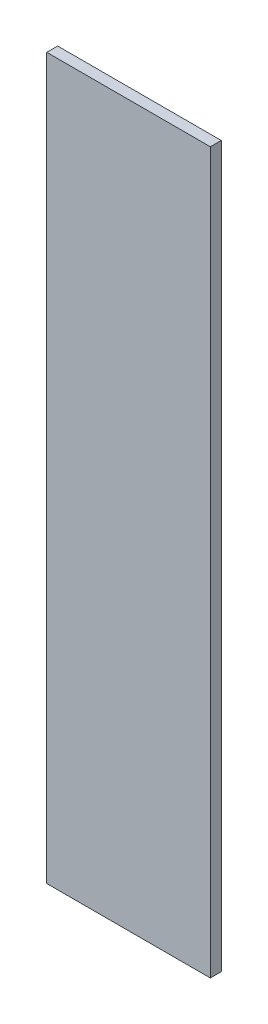
ISO-10303-21;
HEADER;
FILE_DESCRIPTION(('STEP AP214'),'2;1');
FILE_NAME('part.step','',(''),(''),'','','');
FILE_SCHEMA(('AUTOMOTIVE_DESIGN { 1 0 10303 214 1 1 1 1 }'));
ENDSEC;
DATA;
#1=APPLICATION_CONTEXT('core data for automotive mechanical design processes');
#2=APPLICATION_PROTOCOL_DEFINITION('international standard','automotive_design',2000,#1);
#3=PRODUCT_CONTEXT('',#1,'mechanical');
#4=PRODUCT('Part','Part','',(#3));
#5=PRODUCT_RELATED_PRODUCT_CATEGORY('part','',(#4));
#6=PRODUCT_DEFINITION_FORMATION('','',#4);
#7=PRODUCT_DEFINITION_CONTEXT('part definition',#1,'design');
#8=PRODUCT_DEFINITION('design','',#6,#7);
#9=PRODUCT_DEFINITION_SHAPE('','',#8);
#10=(LENGTH_UNIT() NAMED_UNIT(*) SI_UNIT(.MILLI.,.METRE.));
#11=(NAMED_UNIT(*) PLANE_ANGLE_UNIT() SI_UNIT($,.RADIAN.));
#12=(NAMED_UNIT(*) SI_UNIT($,.STERADIAN.) SOLID_ANGLE_UNIT());
#13=UNCERTAINTY_MEASURE_WITH_UNIT(LENGTH_MEASURE(1.E-05),#10,'distance_accuracy_value','');
#14=(GEOMETRIC_REPRESENTATION_CONTEXT(3) GLOBAL_UNCERTAINTY_ASSIGNED_CONTEXT((#13)) GLOBAL_UNIT_ASSIGNED_CONTEXT((#10,
#11,#12)) REPRESENTATION_CONTEXT('',''));
#15=CARTESIAN_POINT('',(0.,0.,0.));
#16=DIRECTION('',(0.,0.,1.));
#17=DIRECTION('',(1.,0.,0.));
#18=AXIS2_PLACEMENT_3D('',#15,#16,#17);
#19=CARTESIAN_POINT('',(95.25,431.8,6.35));
#20=DIRECTION('',(-1.,0.,0.));
#21=DIRECTION('',(0.,-1.,0.));
#22=AXIS2_PLACEMENT_3D('',#19,#20,#21);
#23=PLANE('',#22);
#24=DIRECTION('',(0.,1.,0.));
#25=VECTOR('',#24,1.);
#26=CARTESIAN_POINT('',(95.25,431.8,0.));
#27=LINE('',#26,#25);
#28=CARTESIAN_POINT('',(95.2500000000001,12.7,0.));
#29=VERTEX_POINT('',#28);
#30=CARTESIAN_POINT('',(95.25,431.8,0.));
#31=VERTEX_POINT('',#30);
#32=EDGE_CURVE('E95',#29,#31,#27,.T.);
#33=ORIENTED_EDGE('',*,*,#32,.T.);
#34=DIRECTION('',(0.,0.,-1.));
#35=VECTOR('',#34,1.);
#36=CARTESIAN_POINT('',(95.25,431.8,6.35));
#37=LINE('',#36,#35);
#38=CARTESIAN_POINT('',(95.25,431.8,6.35));
#39=VERTEX_POINT('',#38);
#40=EDGE_CURVE('E11',#39,#31,#37,.T.);
#41=ORIENTED_EDGE('',*,*,#40,.F.);
#42=DIRECTION('',(0.,1.,0.));
#43=VECTOR('',#42,1.);
#44=CARTESIAN_POINT('',(95.25,431.8,6.35));
#45=LINE('',#44,#43);
#46=CARTESIAN_POINT('',(95.2500000000001,12.7,6.35));
#47=VERTEX_POINT('',#46);
#48=EDGE_CURVE('E83',#47,#39,#45,.T.);
#49=ORIENTED_EDGE('',*,*,#48,.F.);
#50=DIRECTION('',(0.,0.,-1.));
#51=VECTOR('',#50,1.);
#52=CARTESIAN_POINT('',(95.2500000000001,12.7,6.35));
#53=LINE('',#52,#51);
#54=EDGE_CURVE('E91',#47,#29,#53,.T.);
#55=ORIENTED_EDGE('',*,*,#54,.T.);
#56=EDGE_LOOP('',(#33,#41,#49,#55));
#57=FACE_BOUND('',#56,.T.);
#58=ADVANCED_FACE('F32',(#57),#23,.F.);
#59=CARTESIAN_POINT('',(0.,431.8,6.35));
#60=DIRECTION('',(0.,-1.,0.));
#61=DIRECTION('',(0.,0.,-1.));
#62=AXIS2_PLACEMENT_3D('',#59,#60,#61);
#63=PLANE('',#62);
#64=DIRECTION('',(-1.,0.,0.));
#65=VECTOR('',#64,1.);
#66=CARTESIAN_POINT('',(0.,431.8,0.));
#67=LINE('',#66,#65);
#68=CARTESIAN_POINT('',(0.,431.8,0.));
#69=VERTEX_POINT('',#68);
#70=EDGE_CURVE('E87',#31,#69,#67,.T.);
#71=ORIENTED_EDGE('',*,*,#70,.T.);
#72=DIRECTION('',(0.,0.,-1.));
#73=VECTOR('',#72,1.);
#74=CARTESIAN_POINT('',(0.,431.8,6.35));
#75=LINE('',#74,#73);
#76=CARTESIAN_POINT('',(0.,431.8,6.35));
#77=VERTEX_POINT('',#76);
#78=EDGE_CURVE('E40',#77,#69,#75,.T.);
#79=ORIENTED_EDGE('',*,*,#78,.F.);
#80=DIRECTION('',(-1.,0.,0.));
#81=VECTOR('',#80,1.);
#82=CARTESIAN_POINT('',(0.,431.8,6.35));
#83=LINE('',#82,#81);
#84=EDGE_CURVE('E78',#39,#77,#83,.T.);
#85=ORIENTED_EDGE('',*,*,#84,.F.);
#86=ORIENTED_EDGE('',*,*,#40,.T.);
#87=EDGE_LOOP('',(#71,#79,#85,#86));
#88=FACE_BOUND('',#87,.T.);
#89=ADVANCED_FACE('F86',(#88),#63,.F.);
#90=CARTESIAN_POINT('',(0.,431.8,6.35));
#91=DIRECTION('',(1.,0.,0.));
#92=DIRECTION('',(0.,1.,0.));
#93=AXIS2_PLACEMENT_3D('',#90,#91,#92);
#94=PLANE('',#93);
#95=DIRECTION('',(0.,-1.,0.));
#96=VECTOR('',#95,1.);
#97=CARTESIAN_POINT('',(0.,431.8,0.));
#98=LINE('',#97,#96);
#99=CARTESIAN_POINT('',(0.,12.7,0.));
#100=VERTEX_POINT('',#99);
#101=EDGE_CURVE('E65',#69,#100,#98,.T.);
#102=ORIENTED_EDGE('',*,*,#101,.T.);
#103=DIRECTION('',(0.,0.,-1.));
#104=VECTOR('',#103,1.);
#105=CARTESIAN_POINT('',(0.,12.7,6.35));
#106=LINE('',#105,#104);
#107=CARTESIAN_POINT('',(0.,12.7,6.35));
#108=VERTEX_POINT('',#107);
#109=EDGE_CURVE('E88',#108,#100,#106,.T.);
#110=ORIENTED_EDGE('',*,*,#109,.F.);
#111=DIRECTION('',(0.,-1.,0.));
#112=VECTOR('',#111,1.);
#113=CARTESIAN_POINT('',(0.,431.8,6.35));
#114=LINE('',#113,#112);
#115=EDGE_CURVE('E81',#77,#108,#114,.T.);
#116=ORIENTED_EDGE('',*,*,#115,.F.);
#117=ORIENTED_EDGE('',*,*,#78,.T.);
#118=EDGE_LOOP('',(#102,#110,#116,#117));
#119=FACE_BOUND('',#118,.T.);
#120=ADVANCED_FACE('F89',(#119),#94,.F.);
#121=CARTESIAN_POINT('',(0.,12.7,6.35));
#122=DIRECTION('',(0.,1.,0.));
#123=DIRECTION('',(0.,0.,1.));
#124=AXIS2_PLACEMENT_3D('',#121,#122,#123);
#125=PLANE('',#124);
#126=DIRECTION('',(1.,0.,0.));
#127=VECTOR('',#126,1.);
#128=CARTESIAN_POINT('',(0.,12.7,0.));
#129=LINE('',#128,#127);
#130=EDGE_CURVE('E71',#100,#29,#129,.T.);
#131=ORIENTED_EDGE('',*,*,#130,.T.);
#132=ORIENTED_EDGE('',*,*,#54,.F.);
#133=DIRECTION('',(1.,0.,0.));
#134=VECTOR('',#133,1.);
#135=CARTESIAN_POINT('',(0.,12.7,6.35));
#136=LINE('',#135,#134);
#137=EDGE_CURVE('E48',#108,#47,#136,.T.);
#138=ORIENTED_EDGE('',*,*,#137,.F.);
#139=ORIENTED_EDGE('',*,*,#109,.T.);
#140=EDGE_LOOP('',(#131,#132,#138,#139));
#141=FACE_BOUND('',#140,.T.);
#142=ADVANCED_FACE('F102',(#141),#125,.F.);
#143=CARTESIAN_POINT('',(0.,0.,6.35));
#144=DIRECTION('',(0.,0.,1.));
#145=DIRECTION('',(1.,0.,0.));
#146=AXIS2_PLACEMENT_3D('',#143,#144,#145);
#147=PLANE('',#146);
#148=ORIENTED_EDGE('',*,*,#48,.T.);
#149=ORIENTED_EDGE('',*,*,#84,.T.);
#150=ORIENTED_EDGE('',*,*,#115,.T.);
#151=ORIENTED_EDGE('',*,*,#137,.T.);
#152=EDGE_LOOP('',(#148,#149,#150,#151));
#153=FACE_BOUND('',#152,.T.);
#154=ADVANCED_FACE('F79',(#153),#147,.T.);
#155=CARTESIAN_POINT('',(0.,0.,0.));
#156=DIRECTION('',(0.,0.,1.));
#157=DIRECTION('',(1.,0.,0.));
#158=AXIS2_PLACEMENT_3D('',#155,#156,#157);
#159=PLANE('',#158);
#160=ORIENTED_EDGE('',*,*,#32,.F.);
#161=ORIENTED_EDGE('',*,*,#130,.F.);
#162=ORIENTED_EDGE('',*,*,#101,.F.);
#163=ORIENTED_EDGE('',*,*,#70,.F.);
#164=EDGE_LOOP('',(#160,#161,#162,#163));
#165=FACE_BOUND('',#164,.T.);
#166=ADVANCED_FACE('F105',(#165),#159,.F.);
#167=CLOSED_SHELL('',(#58,#89,#120,#142,#154,#166));
#168=MANIFOLD_SOLID_BREP('B2',#167);
#169=ADVANCED_BREP_SHAPE_REPRESENTATION('',(#18,#168),#14);
#170=SHAPE_DEFINITION_REPRESENTATION(#9,#169);
ENDSEC;
END-ISO-10303-21;
